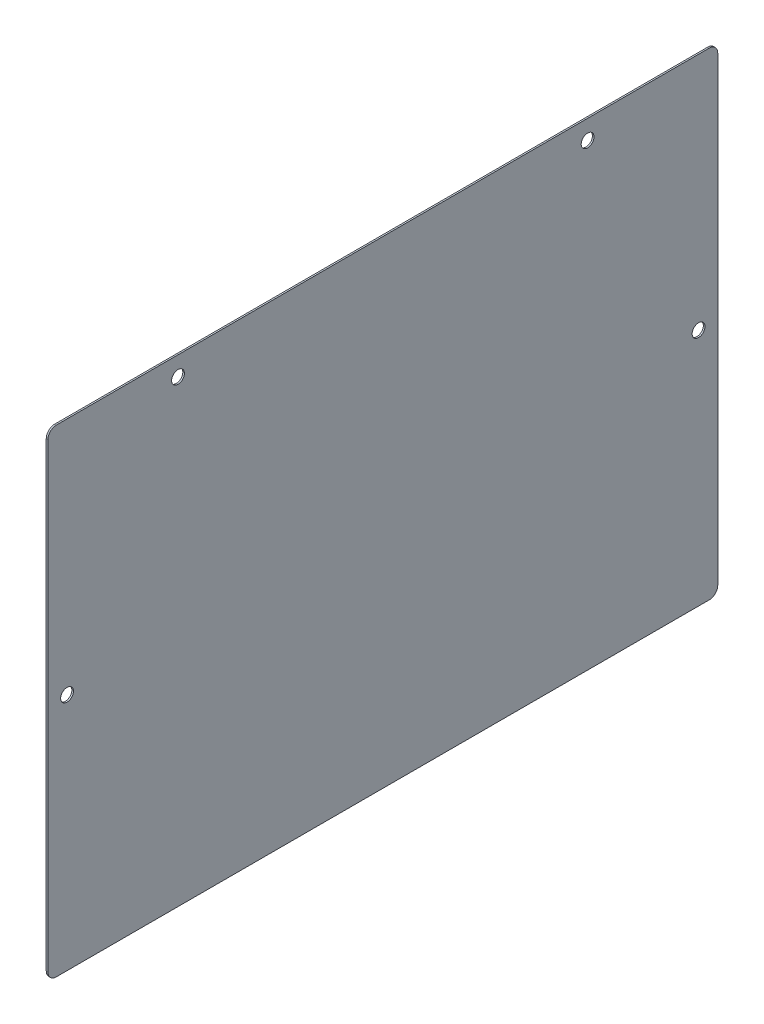
ISO-10303-21;
HEADER;
FILE_DESCRIPTION(('STEP AP214'),'2;1');
FILE_NAME('part.step','',(''),(''),'','','');
FILE_SCHEMA(('AUTOMOTIVE_DESIGN { 1 0 10303 214 1 1 1 1 }'));
ENDSEC;
DATA;
#1=APPLICATION_CONTEXT('core data for automotive mechanical design processes');
#2=APPLICATION_PROTOCOL_DEFINITION('international standard','automotive_design',2000,#1);
#3=PRODUCT_CONTEXT('',#1,'mechanical');
#4=PRODUCT('Part','Part','',(#3));
#5=PRODUCT_RELATED_PRODUCT_CATEGORY('part','',(#4));
#6=PRODUCT_DEFINITION_FORMATION('','',#4);
#7=PRODUCT_DEFINITION_CONTEXT('part definition',#1,'design');
#8=PRODUCT_DEFINITION('design','',#6,#7);
#9=PRODUCT_DEFINITION_SHAPE('','',#8);
#10=(LENGTH_UNIT() NAMED_UNIT(*) SI_UNIT(.MILLI.,.METRE.));
#11=(NAMED_UNIT(*) PLANE_ANGLE_UNIT() SI_UNIT($,.RADIAN.));
#12=(NAMED_UNIT(*) SI_UNIT($,.STERADIAN.) SOLID_ANGLE_UNIT());
#13=UNCERTAINTY_MEASURE_WITH_UNIT(LENGTH_MEASURE(1.E-05),#10,'distance_accuracy_value','');
#14=(GEOMETRIC_REPRESENTATION_CONTEXT(3) GLOBAL_UNCERTAINTY_ASSIGNED_CONTEXT((#13)) GLOBAL_UNIT_ASSIGNED_CONTEXT((#10,
#11,#12)) REPRESENTATION_CONTEXT('',''));
#15=CARTESIAN_POINT('',(0.,0.,0.));
#16=DIRECTION('',(0.,0.,1.));
#17=DIRECTION('',(1.,0.,0.));
#18=AXIS2_PLACEMENT_3D('',#15,#16,#17);
#19=CARTESIAN_POINT('',(-1.1938,-177.8,249.2375));
#20=DIRECTION('',(0.,0.,1.));
#21=DIRECTION('',(1.,0.,0.));
#22=AXIS2_PLACEMENT_3D('',#19,#20,#21);
#23=PLANE('',#22);
#24=DIRECTION('',(0.,-1.,0.));
#25=VECTOR('',#24,1.);
#26=CARTESIAN_POINT('',(-1.1938,-177.8,249.2375));
#27=LINE('',#26,#25);
#28=CARTESIAN_POINT('',(-1.1938,171.45,249.2375));
#29=VERTEX_POINT('',#28);
#30=CARTESIAN_POINT('',(-1.1938,-171.45,249.2375));
#31=VERTEX_POINT('',#30);
#32=EDGE_CURVE('E187',#29,#31,#27,.T.);
#33=ORIENTED_EDGE('',*,*,#32,.T.);
#34=DIRECTION('',(1.,0.,0.));
#35=VECTOR('',#34,1.);
#36=CARTESIAN_POINT('',(-1.1938,-171.45,249.2375));
#37=LINE('',#36,#35);
#38=CARTESIAN_POINT('',(0.,-171.45,249.2375));
#39=VERTEX_POINT('',#38);
#40=EDGE_CURVE('E11',#31,#39,#37,.T.);
#41=ORIENTED_EDGE('',*,*,#40,.T.);
#42=DIRECTION('',(0.,-1.,0.));
#43=VECTOR('',#42,1.);
#44=CARTESIAN_POINT('',(0.,-177.8,249.2375));
#45=LINE('',#44,#43);
#46=CARTESIAN_POINT('',(0.,171.45,249.2375));
#47=VERTEX_POINT('',#46);
#48=EDGE_CURVE('E120',#47,#39,#45,.T.);
#49=ORIENTED_EDGE('',*,*,#48,.F.);
#50=DIRECTION('',(1.,0.,0.));
#51=VECTOR('',#50,1.);
#52=CARTESIAN_POINT('',(-1.1938,171.45,249.2375));
#53=LINE('',#52,#51);
#54=EDGE_CURVE('E56',#47,#29,#53,.F.);
#55=ORIENTED_EDGE('',*,*,#54,.T.);
#56=EDGE_LOOP('',(#33,#41,#49,#55));
#57=FACE_BOUND('',#56,.T.);
#58=ADVANCED_FACE('F47',(#57),#23,.T.);
#59=CARTESIAN_POINT('',(-1.1938,177.8,-249.2375));
#60=DIRECTION('',(0.,1.,0.));
#61=DIRECTION('',(0.,0.,1.));
#62=AXIS2_PLACEMENT_3D('',#59,#60,#61);
#63=PLANE('',#62);
#64=DIRECTION('',(0.,0.,1.));
#65=VECTOR('',#64,1.);
#66=CARTESIAN_POINT('',(0.,177.8,-249.2375));
#67=LINE('',#66,#65);
#68=CARTESIAN_POINT('',(0.,177.8,-242.8875));
#69=VERTEX_POINT('',#68);
#70=CARTESIAN_POINT('',(0.,177.8,242.8875));
#71=VERTEX_POINT('',#70);
#72=EDGE_CURVE('E151',#69,#71,#67,.T.);
#73=ORIENTED_EDGE('',*,*,#72,.F.);
#74=DIRECTION('',(1.,0.,0.));
#75=VECTOR('',#74,1.);
#76=CARTESIAN_POINT('',(-1.1938,177.8,-242.8875));
#77=LINE('',#76,#75);
#78=CARTESIAN_POINT('',(-1.1938,177.8,-242.8875));
#79=VERTEX_POINT('',#78);
#80=EDGE_CURVE('E70',#69,#79,#77,.F.);
#81=ORIENTED_EDGE('',*,*,#80,.T.);
#82=DIRECTION('',(0.,0.,1.));
#83=VECTOR('',#82,1.);
#84=CARTESIAN_POINT('',(-1.1938,177.8,-249.2375));
#85=LINE('',#84,#83);
#86=CARTESIAN_POINT('',(-1.1938,177.8,242.8875));
#87=VERTEX_POINT('',#86);
#88=EDGE_CURVE('E143',#79,#87,#85,.T.);
#89=ORIENTED_EDGE('',*,*,#88,.T.);
#90=DIRECTION('',(1.,0.,0.));
#91=VECTOR('',#90,1.);
#92=CARTESIAN_POINT('',(-1.1938,177.8,242.8875));
#93=LINE('',#92,#91);
#94=EDGE_CURVE('E178',#87,#71,#93,.T.);
#95=ORIENTED_EDGE('',*,*,#94,.T.);
#96=EDGE_LOOP('',(#73,#81,#89,#95));
#97=FACE_BOUND('',#96,.T.);
#98=ADVANCED_FACE('F196',(#97),#63,.T.);
#99=CARTESIAN_POINT('',(-1.1938,-177.8,-249.2375));
#100=DIRECTION('',(0.,0.,-1.));
#101=DIRECTION('',(-1.,0.,0.));
#102=AXIS2_PLACEMENT_3D('',#99,#100,#101);
#103=PLANE('',#102);
#104=DIRECTION('',(0.,1.,0.));
#105=VECTOR('',#104,1.);
#106=CARTESIAN_POINT('',(0.,-177.8,-249.2375));
#107=LINE('',#106,#105);
#108=CARTESIAN_POINT('',(0.,-171.45,-249.2375));
#109=VERTEX_POINT('',#108);
#110=CARTESIAN_POINT('',(0.,171.45,-249.2375));
#111=VERTEX_POINT('',#110);
#112=EDGE_CURVE('E137',#109,#111,#107,.T.);
#113=ORIENTED_EDGE('',*,*,#112,.F.);
#114=DIRECTION('',(1.,0.,0.));
#115=VECTOR('',#114,1.);
#116=CARTESIAN_POINT('',(-1.1938,-171.45,-249.2375));
#117=LINE('',#116,#115);
#118=CARTESIAN_POINT('',(-1.1938,-171.45,-249.2375));
#119=VERTEX_POINT('',#118);
#120=EDGE_CURVE('E165',#109,#119,#117,.F.);
#121=ORIENTED_EDGE('',*,*,#120,.T.);
#122=DIRECTION('',(0.,1.,0.));
#123=VECTOR('',#122,1.);
#124=CARTESIAN_POINT('',(-1.1938,-177.8,-249.2375));
#125=LINE('',#124,#123);
#126=CARTESIAN_POINT('',(-1.1938,171.45,-249.2375));
#127=VERTEX_POINT('',#126);
#128=EDGE_CURVE('E148',#119,#127,#125,.T.);
#129=ORIENTED_EDGE('',*,*,#128,.T.);
#130=DIRECTION('',(1.,0.,0.));
#131=VECTOR('',#130,1.);
#132=CARTESIAN_POINT('',(-1.1938,171.45,-249.2375));
#133=LINE('',#132,#131);
#134=EDGE_CURVE('E161',#127,#111,#133,.T.);
#135=ORIENTED_EDGE('',*,*,#134,.T.);
#136=EDGE_LOOP('',(#113,#121,#129,#135));
#137=FACE_BOUND('',#136,.T.);
#138=ADVANCED_FACE('F278',(#137),#103,.T.);
#139=CARTESIAN_POINT('',(-1.1938,-177.8,-249.2375));
#140=DIRECTION('',(0.,-1.,0.));
#141=DIRECTION('',(0.,0.,-1.));
#142=AXIS2_PLACEMENT_3D('',#139,#140,#141);
#143=PLANE('',#142);
#144=DIRECTION('',(0.,0.,-1.));
#145=VECTOR('',#144,1.);
#146=CARTESIAN_POINT('',(-1.1938,-177.8,-249.2375));
#147=LINE('',#146,#145);
#148=CARTESIAN_POINT('',(-1.1938,-177.8,242.8875));
#149=VERTEX_POINT('',#148);
#150=CARTESIAN_POINT('',(-1.1938,-177.8,-242.8875));
#151=VERTEX_POINT('',#150);
#152=EDGE_CURVE('E192',#149,#151,#147,.T.);
#153=ORIENTED_EDGE('',*,*,#152,.T.);
#154=DIRECTION('',(1.,0.,0.));
#155=VECTOR('',#154,1.);
#156=CARTESIAN_POINT('',(-1.1938,-177.8,-242.8875));
#157=LINE('',#156,#155);
#158=CARTESIAN_POINT('',(0.,-177.8,-242.8875));
#159=VERTEX_POINT('',#158);
#160=EDGE_CURVE('E135',#151,#159,#157,.T.);
#161=ORIENTED_EDGE('',*,*,#160,.T.);
#162=DIRECTION('',(0.,0.,-1.));
#163=VECTOR('',#162,1.);
#164=CARTESIAN_POINT('',(0.,-177.8,-249.2375));
#165=LINE('',#164,#163);
#166=CARTESIAN_POINT('',(0.,-177.8,242.8875));
#167=VERTEX_POINT('',#166);
#168=EDGE_CURVE('E118',#167,#159,#165,.T.);
#169=ORIENTED_EDGE('',*,*,#168,.F.);
#170=DIRECTION('',(1.,0.,0.));
#171=VECTOR('',#170,1.);
#172=CARTESIAN_POINT('',(-1.1938,-177.8,242.8875));
#173=LINE('',#172,#171);
#174=EDGE_CURVE('E132',#167,#149,#173,.F.);
#175=ORIENTED_EDGE('',*,*,#174,.T.);
#176=EDGE_LOOP('',(#153,#161,#169,#175));
#177=FACE_BOUND('',#176,.T.);
#178=ADVANCED_FACE('F131',(#177),#143,.T.);
#179=CARTESIAN_POINT('',(-1.1938,0.,0.));
#180=DIRECTION('',(1.,0.,0.));
#181=DIRECTION('',(0.,0.,-1.));
#182=AXIS2_PLACEMENT_3D('',#179,#180,#181);
#183=PLANE('',#182);
#184=CARTESIAN_POINT('',(-1.1938,163.5125,-152.4));
#185=DIRECTION('',(1.,0.,0.));
#186=DIRECTION('',(0.,0.,-1.));
#187=AXIS2_PLACEMENT_3D('',#184,#185,#186);
#188=CIRCLE('',#187,4.76250000000001);
#189=CARTESIAN_POINT('',(-1.1938,163.5125,-157.1625));
#190=VERTEX_POINT('',#189);
#191=EDGE_CURVE('E234',#190,#190,#188,.T.);
#192=ORIENTED_EDGE('',*,*,#191,.T.);
#193=EDGE_LOOP('',(#192));
#194=FACE_BOUND('',#193,.T.);
#195=CARTESIAN_POINT('',(-1.1938,0.,-234.95));
#196=DIRECTION('',(1.,0.,0.));
#197=DIRECTION('',(0.,0.,-1.));
#198=AXIS2_PLACEMENT_3D('',#195,#196,#197);
#199=CIRCLE('',#198,4.76250000000001);
#200=CARTESIAN_POINT('',(-1.1938,0.,-239.7125));
#201=VERTEX_POINT('',#200);
#202=EDGE_CURVE('E226',#201,#201,#199,.T.);
#203=ORIENTED_EDGE('',*,*,#202,.T.);
#204=EDGE_LOOP('',(#203));
#205=FACE_BOUND('',#204,.T.);
#206=CARTESIAN_POINT('',(-1.1938,163.5125,152.4));
#207=DIRECTION('',(1.,0.,0.));
#208=DIRECTION('',(0.,0.,-1.));
#209=AXIS2_PLACEMENT_3D('',#206,#207,#208);
#210=CIRCLE('',#209,4.76250000000001);
#211=CARTESIAN_POINT('',(-1.1938,163.5125,147.6375));
#212=VERTEX_POINT('',#211);
#213=EDGE_CURVE('E203',#212,#212,#210,.F.);
#214=ORIENTED_EDGE('',*,*,#213,.F.);
#215=EDGE_LOOP('',(#214));
#216=FACE_BOUND('',#215,.T.);
#217=CARTESIAN_POINT('',(-1.1938,0.,234.95));
#218=DIRECTION('',(1.,0.,0.));
#219=DIRECTION('',(0.,0.,-1.));
#220=AXIS2_PLACEMENT_3D('',#217,#218,#219);
#221=CIRCLE('',#220,4.76250000000001);
#222=CARTESIAN_POINT('',(-1.1938,0.,230.1875));
#223=VERTEX_POINT('',#222);
#224=EDGE_CURVE('E210',#223,#223,#221,.F.);
#225=ORIENTED_EDGE('',*,*,#224,.F.);
#226=EDGE_LOOP('',(#225));
#227=FACE_BOUND('',#226,.T.);
#228=ORIENTED_EDGE('',*,*,#128,.F.);
#229=CARTESIAN_POINT('',(-1.1938,-171.45,-242.8875));
#230=DIRECTION('',(1.,0.,0.));
#231=DIRECTION('',(0.,0.,-1.));
#232=AXIS2_PLACEMENT_3D('',#229,#230,#231);
#233=CIRCLE('',#232,6.35);
#234=EDGE_CURVE('E175',#119,#151,#233,.F.);
#235=ORIENTED_EDGE('',*,*,#234,.T.);
#236=ORIENTED_EDGE('',*,*,#152,.F.);
#237=CARTESIAN_POINT('',(-1.1938,-171.45,242.8875));
#238=DIRECTION('',(1.,0.,0.));
#239=DIRECTION('',(0.,0.,-1.));
#240=AXIS2_PLACEMENT_3D('',#237,#238,#239);
#241=CIRCLE('',#240,6.35);
#242=EDGE_CURVE('E141',#149,#31,#241,.F.);
#243=ORIENTED_EDGE('',*,*,#242,.T.);
#244=ORIENTED_EDGE('',*,*,#32,.F.);
#245=CARTESIAN_POINT('',(-1.1938,171.45,242.8875));
#246=DIRECTION('',(1.,0.,0.));
#247=DIRECTION('',(0.,0.,-1.));
#248=AXIS2_PLACEMENT_3D('',#245,#246,#247);
#249=CIRCLE('',#248,6.35);
#250=EDGE_CURVE('E63',#29,#87,#249,.F.);
#251=ORIENTED_EDGE('',*,*,#250,.T.);
#252=ORIENTED_EDGE('',*,*,#88,.F.);
#253=CARTESIAN_POINT('',(-1.1938,171.45,-242.8875));
#254=DIRECTION('',(1.,0.,0.));
#255=DIRECTION('',(0.,0.,-1.));
#256=AXIS2_PLACEMENT_3D('',#253,#254,#255);
#257=CIRCLE('',#256,6.35);
#258=EDGE_CURVE('E172',#79,#127,#257,.F.);
#259=ORIENTED_EDGE('',*,*,#258,.T.);
#260=EDGE_LOOP('',(#228,#235,#236,#243,#244,#251,#252,#259));
#261=FACE_BOUND('',#260,.T.);
#262=ADVANCED_FACE('F190',(#194,#205,#216,#227,#261),#183,.F.);
#263=CARTESIAN_POINT('',(0.,0.,0.));
#264=DIRECTION('',(1.,0.,0.));
#265=DIRECTION('',(0.,0.,-1.));
#266=AXIS2_PLACEMENT_3D('',#263,#264,#265);
#267=PLANE('',#266);
#268=CARTESIAN_POINT('',(0.,163.5125,-152.4));
#269=DIRECTION('',(-1.,0.,0.));
#270=DIRECTION('',(0.,0.,1.));
#271=AXIS2_PLACEMENT_3D('',#268,#269,#270);
#272=CIRCLE('',#271,4.76250000000001);
#273=CARTESIAN_POINT('',(0.,163.5125,-147.6375));
#274=VERTEX_POINT('',#273);
#275=EDGE_CURVE('E219',#274,#274,#272,.T.);
#276=ORIENTED_EDGE('',*,*,#275,.T.);
#277=EDGE_LOOP('',(#276));
#278=FACE_BOUND('',#277,.T.);
#279=CARTESIAN_POINT('',(0.,0.,-234.95));
#280=DIRECTION('',(-1.,0.,0.));
#281=DIRECTION('',(0.,0.,1.));
#282=AXIS2_PLACEMENT_3D('',#279,#280,#281);
#283=CIRCLE('',#282,4.76250000000001);
#284=CARTESIAN_POINT('',(0.,0.,-230.1875));
#285=VERTEX_POINT('',#284);
#286=EDGE_CURVE('E230',#285,#285,#283,.T.);
#287=ORIENTED_EDGE('',*,*,#286,.T.);
#288=EDGE_LOOP('',(#287));
#289=FACE_BOUND('',#288,.T.);
#290=CARTESIAN_POINT('',(0.,163.5125,152.4));
#291=DIRECTION('',(1.,0.,0.));
#292=DIRECTION('',(0.,0.,-1.));
#293=AXIS2_PLACEMENT_3D('',#290,#291,#292);
#294=CIRCLE('',#293,4.76250000000001);
#295=CARTESIAN_POINT('',(0.,163.5125,147.6375));
#296=VERTEX_POINT('',#295);
#297=EDGE_CURVE('E214',#296,#296,#294,.T.);
#298=ORIENTED_EDGE('',*,*,#297,.F.);
#299=EDGE_LOOP('',(#298));
#300=FACE_BOUND('',#299,.T.);
#301=CARTESIAN_POINT('',(0.,0.,234.95));
#302=DIRECTION('',(1.,0.,0.));
#303=DIRECTION('',(0.,0.,-1.));
#304=AXIS2_PLACEMENT_3D('',#301,#302,#303);
#305=CIRCLE('',#304,4.76250000000001);
#306=CARTESIAN_POINT('',(0.,0.,230.1875));
#307=VERTEX_POINT('',#306);
#308=EDGE_CURVE('E215',#307,#307,#305,.T.);
#309=ORIENTED_EDGE('',*,*,#308,.F.);
#310=EDGE_LOOP('',(#309));
#311=FACE_BOUND('',#310,.T.);
#312=ORIENTED_EDGE('',*,*,#168,.T.);
#313=CARTESIAN_POINT('',(0.,-171.45,-242.8875));
#314=DIRECTION('',(1.,0.,0.));
#315=DIRECTION('',(0.,0.,-1.));
#316=AXIS2_PLACEMENT_3D('',#313,#314,#315);
#317=CIRCLE('',#316,6.35);
#318=EDGE_CURVE('E158',#159,#109,#317,.T.);
#319=ORIENTED_EDGE('',*,*,#318,.T.);
#320=ORIENTED_EDGE('',*,*,#112,.T.);
#321=CARTESIAN_POINT('',(0.,171.45,-242.8875));
#322=DIRECTION('',(1.,0.,0.));
#323=DIRECTION('',(0.,0.,-1.));
#324=AXIS2_PLACEMENT_3D('',#321,#322,#323);
#325=CIRCLE('',#324,6.35);
#326=EDGE_CURVE('E125',#111,#69,#325,.T.);
#327=ORIENTED_EDGE('',*,*,#326,.T.);
#328=ORIENTED_EDGE('',*,*,#72,.T.);
#329=CARTESIAN_POINT('',(0.,171.45,242.8875));
#330=DIRECTION('',(1.,0.,0.));
#331=DIRECTION('',(0.,0.,-1.));
#332=AXIS2_PLACEMENT_3D('',#329,#330,#331);
#333=CIRCLE('',#332,6.35);
#334=EDGE_CURVE('E126',#71,#47,#333,.T.);
#335=ORIENTED_EDGE('',*,*,#334,.T.);
#336=ORIENTED_EDGE('',*,*,#48,.T.);
#337=CARTESIAN_POINT('',(0.,-171.45,242.8875));
#338=DIRECTION('',(1.,0.,0.));
#339=DIRECTION('',(0.,0.,-1.));
#340=AXIS2_PLACEMENT_3D('',#337,#338,#339);
#341=CIRCLE('',#340,6.35);
#342=EDGE_CURVE('E115',#39,#167,#341,.T.);
#343=ORIENTED_EDGE('',*,*,#342,.T.);
#344=EDGE_LOOP('',(#312,#319,#320,#327,#328,#335,#336,#343));
#345=FACE_BOUND('',#344,.T.);
#346=ADVANCED_FACE('F117',(#278,#289,#300,#311,#345),#267,.T.);
#347=CARTESIAN_POINT('',(-1.1948,0.,234.95));
#348=DIRECTION('',(1.,0.,0.));
#349=DIRECTION('',(0.,0.,-1.));
#350=AXIS2_PLACEMENT_3D('',#347,#348,#349);
#351=CYLINDRICAL_SURFACE('',#350,4.76250000000001);
#352=ORIENTED_EDGE('',*,*,#308,.T.);
#353=EDGE_LOOP('',(#352));
#354=FACE_BOUND('',#353,.T.);
#355=ORIENTED_EDGE('',*,*,#224,.T.);
#356=EDGE_LOOP('',(#355));
#357=FACE_BOUND('',#356,.T.);
#358=ADVANCED_FACE('F261',(#354,#357),#351,.F.);
#359=CARTESIAN_POINT('',(-1.1948,163.5125,152.4));
#360=DIRECTION('',(1.,0.,0.));
#361=DIRECTION('',(0.,0.,-1.));
#362=AXIS2_PLACEMENT_3D('',#359,#360,#361);
#363=CYLINDRICAL_SURFACE('',#362,4.76250000000001);
#364=ORIENTED_EDGE('',*,*,#297,.T.);
#365=EDGE_LOOP('',(#364));
#366=FACE_BOUND('',#365,.T.);
#367=ORIENTED_EDGE('',*,*,#213,.T.);
#368=EDGE_LOOP('',(#367));
#369=FACE_BOUND('',#368,.T.);
#370=ADVANCED_FACE('F263',(#366,#369),#363,.F.);
#371=CARTESIAN_POINT('',(-1.1948,0.,-234.95));
#372=DIRECTION('',(1.,0.,0.));
#373=DIRECTION('',(0.,0.,-1.));
#374=AXIS2_PLACEMENT_3D('',#371,#372,#373);
#375=CYLINDRICAL_SURFACE('',#374,4.76250000000001);
#376=ORIENTED_EDGE('',*,*,#286,.F.);
#377=EDGE_LOOP('',(#376));
#378=FACE_BOUND('',#377,.T.);
#379=ORIENTED_EDGE('',*,*,#202,.F.);
#380=EDGE_LOOP('',(#379));
#381=FACE_BOUND('',#380,.T.);
#382=ADVANCED_FACE('F248',(#378,#381),#375,.F.);
#383=CARTESIAN_POINT('',(-1.1948,163.5125,-152.4));
#384=DIRECTION('',(1.,0.,0.));
#385=DIRECTION('',(0.,0.,-1.));
#386=AXIS2_PLACEMENT_3D('',#383,#384,#385);
#387=CYLINDRICAL_SURFACE('',#386,4.76250000000001);
#388=ORIENTED_EDGE('',*,*,#275,.F.);
#389=EDGE_LOOP('',(#388));
#390=FACE_BOUND('',#389,.T.);
#391=ORIENTED_EDGE('',*,*,#191,.F.);
#392=EDGE_LOOP('',(#391));
#393=FACE_BOUND('',#392,.T.);
#394=ADVANCED_FACE('F244',(#390,#393),#387,.F.);
#395=CARTESIAN_POINT('',(-1.1938,-171.45,-242.8875));
#396=DIRECTION('',(1.,0.,0.));
#397=DIRECTION('',(0.,0.,-1.));
#398=AXIS2_PLACEMENT_3D('',#395,#396,#397);
#399=CYLINDRICAL_SURFACE('',#398,6.35);
#400=ORIENTED_EDGE('',*,*,#234,.F.);
#401=ORIENTED_EDGE('',*,*,#120,.F.);
#402=ORIENTED_EDGE('',*,*,#318,.F.);
#403=ORIENTED_EDGE('',*,*,#160,.F.);
#404=EDGE_LOOP('',(#400,#401,#402,#403));
#405=FACE_BOUND('',#404,.T.);
#406=ADVANCED_FACE('F247',(#405),#399,.T.);
#407=CARTESIAN_POINT('',(-1.1938,171.45,-242.8875));
#408=DIRECTION('',(1.,0.,0.));
#409=DIRECTION('',(0.,0.,-1.));
#410=AXIS2_PLACEMENT_3D('',#407,#408,#409);
#411=CYLINDRICAL_SURFACE('',#410,6.35);
#412=ORIENTED_EDGE('',*,*,#258,.F.);
#413=ORIENTED_EDGE('',*,*,#80,.F.);
#414=ORIENTED_EDGE('',*,*,#326,.F.);
#415=ORIENTED_EDGE('',*,*,#134,.F.);
#416=EDGE_LOOP('',(#412,#413,#414,#415));
#417=FACE_BOUND('',#416,.T.);
#418=ADVANCED_FACE('F285',(#417),#411,.T.);
#419=CARTESIAN_POINT('',(-1.1938,-171.45,242.8875));
#420=DIRECTION('',(1.,0.,0.));
#421=DIRECTION('',(0.,0.,-1.));
#422=AXIS2_PLACEMENT_3D('',#419,#420,#421);
#423=CYLINDRICAL_SURFACE('',#422,6.35);
#424=ORIENTED_EDGE('',*,*,#242,.F.);
#425=ORIENTED_EDGE('',*,*,#174,.F.);
#426=ORIENTED_EDGE('',*,*,#342,.F.);
#427=ORIENTED_EDGE('',*,*,#40,.F.);
#428=EDGE_LOOP('',(#424,#425,#426,#427));
#429=FACE_BOUND('',#428,.T.);
#430=ADVANCED_FACE('F140',(#429),#423,.T.);
#431=CARTESIAN_POINT('',(-1.1938,171.45,242.8875));
#432=DIRECTION('',(1.,0.,0.));
#433=DIRECTION('',(0.,0.,-1.));
#434=AXIS2_PLACEMENT_3D('',#431,#432,#433);
#435=CYLINDRICAL_SURFACE('',#434,6.35);
#436=ORIENTED_EDGE('',*,*,#250,.F.);
#437=ORIENTED_EDGE('',*,*,#54,.F.);
#438=ORIENTED_EDGE('',*,*,#334,.F.);
#439=ORIENTED_EDGE('',*,*,#94,.F.);
#440=EDGE_LOOP('',(#436,#437,#438,#439));
#441=FACE_BOUND('',#440,.T.);
#442=ADVANCED_FACE('F49',(#441),#435,.T.);
#443=CLOSED_SHELL('',(#58,#98,#138,#178,#262,#346,#358,#370,#382,#394,#406,#418,#430,#442));
#444=MANIFOLD_SOLID_BREP('B2',#443);
#445=ADVANCED_BREP_SHAPE_REPRESENTATION('',(#18,#444),#14);
#446=SHAPE_DEFINITION_REPRESENTATION(#9,#445);
ENDSEC;
END-ISO-10303-21;
